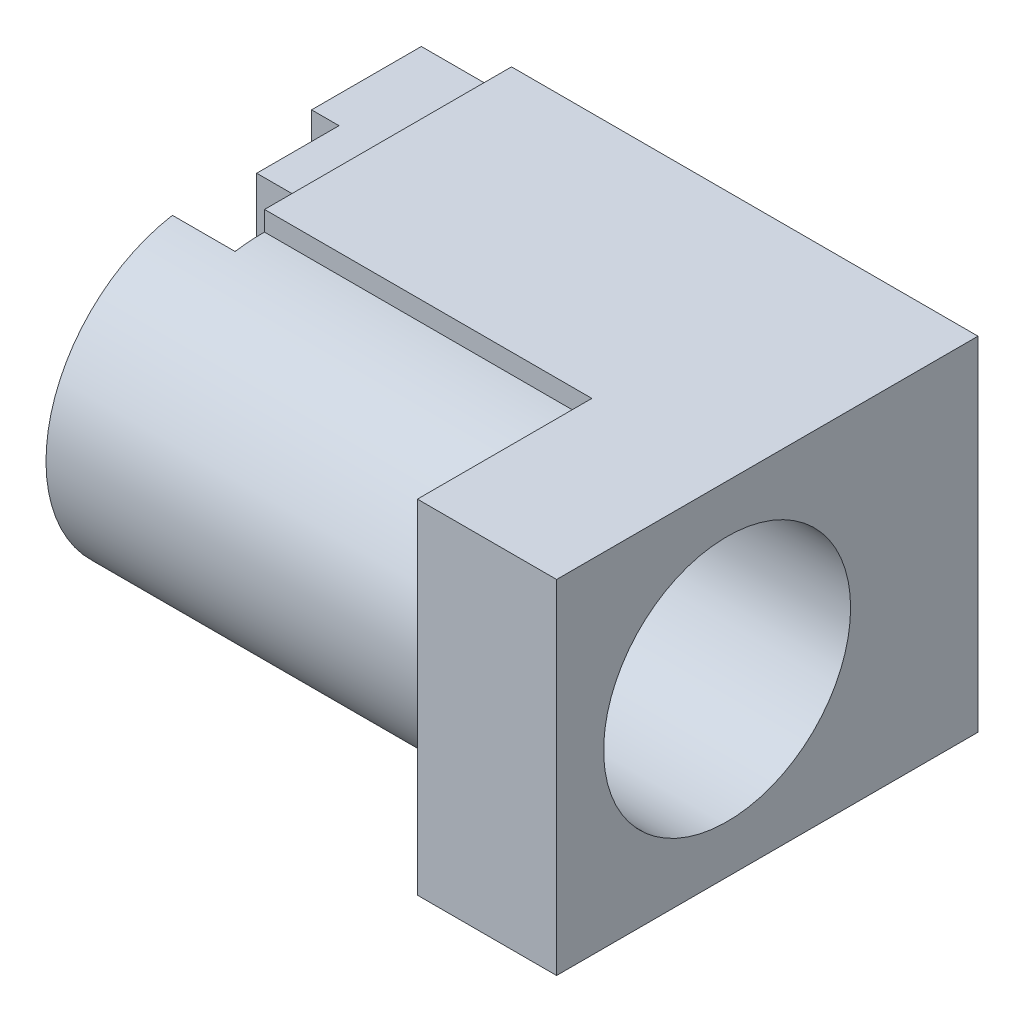
ISO-10303-21;
HEADER;
FILE_DESCRIPTION(('STEP AP214'),'2;1');
FILE_NAME('part.step','',(''),(''),'','','');
FILE_SCHEMA(('AUTOMOTIVE_DESIGN { 1 0 10303 214 1 1 1 1 }'));
ENDSEC;
DATA;
#1=APPLICATION_CONTEXT('core data for automotive mechanical design processes');
#2=APPLICATION_PROTOCOL_DEFINITION('international standard','automotive_design',2000,#1);
#3=PRODUCT_CONTEXT('',#1,'mechanical');
#4=PRODUCT('Part','Part','',(#3));
#5=PRODUCT_RELATED_PRODUCT_CATEGORY('part','',(#4));
#6=PRODUCT_DEFINITION_FORMATION('','',#4);
#7=PRODUCT_DEFINITION_CONTEXT('part definition',#1,'design');
#8=PRODUCT_DEFINITION('design','',#6,#7);
#9=PRODUCT_DEFINITION_SHAPE('','',#8);
#10=(LENGTH_UNIT() NAMED_UNIT(*) SI_UNIT(.MILLI.,.METRE.));
#11=(NAMED_UNIT(*) PLANE_ANGLE_UNIT() SI_UNIT($,.RADIAN.));
#12=(NAMED_UNIT(*) SI_UNIT($,.STERADIAN.) SOLID_ANGLE_UNIT());
#13=UNCERTAINTY_MEASURE_WITH_UNIT(LENGTH_MEASURE(1.E-05),#10,'distance_accuracy_value','');
#14=(GEOMETRIC_REPRESENTATION_CONTEXT(3) GLOBAL_UNCERTAINTY_ASSIGNED_CONTEXT((#13)) GLOBAL_UNIT_ASSIGNED_CONTEXT((#10,
#11,#12)) REPRESENTATION_CONTEXT('',''));
#15=CARTESIAN_POINT('',(0.,0.,0.));
#16=DIRECTION('',(0.,0.,1.));
#17=DIRECTION('',(1.,0.,0.));
#18=AXIS2_PLACEMENT_3D('',#15,#16,#17);
#19=CARTESIAN_POINT('',(-9.95,-3.87370946251781,2.8));
#20=DIRECTION('',(0.,0.,1.));
#21=DIRECTION('',(1.,0.,0.));
#22=AXIS2_PLACEMENT_3D('',#19,#20,#21);
#23=PLANE('',#22);
#24=DIRECTION('',(0.,1.,0.));
#25=VECTOR('',#24,1.);
#26=CARTESIAN_POINT('',(-10.65,-2.63685473125891,2.8));
#27=LINE('',#26,#25);
#28=CARTESIAN_POINT('',(-10.65,-1.4,2.8));
#29=VERTEX_POINT('',#28);
#30=CARTESIAN_POINT('',(-10.65,-3.87370946251781,2.8));
#31=VERTEX_POINT('',#30);
#32=EDGE_CURVE('E200',#29,#31,#27,.F.);
#33=ORIENTED_EDGE('',*,*,#32,.T.);
#34=DIRECTION('',(1.,0.,0.));
#35=VECTOR('',#34,1.);
#36=CARTESIAN_POINT('',(-8.35,-3.87370946251781,2.8));
#37=LINE('',#36,#35);
#38=CARTESIAN_POINT('',(-9.95,-3.87370946251781,2.8));
#39=VERTEX_POINT('',#38);
#40=EDGE_CURVE('E168',#39,#31,#37,.F.);
#41=ORIENTED_EDGE('',*,*,#40,.F.);
#42=DIRECTION('',(0.,1.,0.));
#43=VECTOR('',#42,1.);
#44=CARTESIAN_POINT('',(-9.95,0.139499279654936,2.8));
#45=LINE('',#44,#43);
#46=CARTESIAN_POINT('',(-9.95,-1.4,2.8));
#47=VERTEX_POINT('',#46);
#48=EDGE_CURVE('E178',#39,#47,#45,.T.);
#49=ORIENTED_EDGE('',*,*,#48,.T.);
#50=DIRECTION('',(1.,0.,0.));
#51=VECTOR('',#50,1.);
#52=CARTESIAN_POINT('',(-9.95,-1.4,2.8));
#53=LINE('',#52,#51);
#54=EDGE_CURVE('E276',#29,#47,#53,.T.);
#55=ORIENTED_EDGE('',*,*,#54,.F.);
#56=EDGE_LOOP('',(#33,#41,#49,#55));
#57=FACE_BOUND('',#56,.T.);
#58=ADVANCED_FACE('F16',(#57),#23,.T.);
#59=CARTESIAN_POINT('',(-9.95,-1.4,2.8));
#60=DIRECTION('',(0.,1.,0.));
#61=DIRECTION('',(0.,0.,1.));
#62=AXIS2_PLACEMENT_3D('',#59,#60,#61);
#63=PLANE('',#62);
#64=DIRECTION('',(0.,0.,-1.));
#65=VECTOR('',#64,1.);
#66=CARTESIAN_POINT('',(-10.65,-1.4,1.4));
#67=LINE('',#66,#65);
#68=CARTESIAN_POINT('',(-10.65,-1.4,0.));
#69=VERTEX_POINT('',#68);
#70=EDGE_CURVE('E197',#69,#29,#67,.F.);
#71=ORIENTED_EDGE('',*,*,#70,.T.);
#72=ORIENTED_EDGE('',*,*,#54,.T.);
#73=DIRECTION('',(0.,0.,-1.));
#74=VECTOR('',#73,1.);
#75=CARTESIAN_POINT('',(-9.95,-1.4,4.32299122435101));
#76=LINE('',#75,#74);
#77=CARTESIAN_POINT('',(-9.95,-1.4,0.));
#78=VERTEX_POINT('',#77);
#79=EDGE_CURVE('E284',#47,#78,#76,.T.);
#80=ORIENTED_EDGE('',*,*,#79,.T.);
#81=DIRECTION('',(1.,0.,0.));
#82=VECTOR('',#81,1.);
#83=CARTESIAN_POINT('',(-9.95,-1.4,0.));
#84=LINE('',#83,#82);
#85=EDGE_CURVE('E278',#78,#69,#84,.F.);
#86=ORIENTED_EDGE('',*,*,#85,.T.);
#87=EDGE_LOOP('',(#71,#72,#80,#86));
#88=FACE_BOUND('',#87,.T.);
#89=ADVANCED_FACE('F344',(#88),#63,.T.);
#90=CARTESIAN_POINT('',(-9.95,1.4,2.8));
#91=DIRECTION('',(0.,0.,1.));
#92=DIRECTION('',(1.,0.,0.));
#93=AXIS2_PLACEMENT_3D('',#90,#91,#92);
#94=PLANE('',#93);
#95=DIRECTION('',(0.,1.,0.));
#96=VECTOR('',#95,1.);
#97=CARTESIAN_POINT('',(-10.65,2.5375,2.8));
#98=LINE('',#97,#96);
#99=CARTESIAN_POINT('',(-10.65,3.675,2.8));
#100=VERTEX_POINT('',#99);
#101=CARTESIAN_POINT('',(-10.65,1.4,2.8));
#102=VERTEX_POINT('',#101);
#103=EDGE_CURVE('E336',#100,#102,#98,.F.);
#104=ORIENTED_EDGE('',*,*,#103,.T.);
#105=DIRECTION('',(1.,0.,0.));
#106=VECTOR('',#105,1.);
#107=CARTESIAN_POINT('',(-9.95,1.4,2.8));
#108=LINE('',#107,#106);
#109=CARTESIAN_POINT('',(-9.95,1.4,2.8));
#110=VERTEX_POINT('',#109);
#111=EDGE_CURVE('E272',#110,#102,#108,.F.);
#112=ORIENTED_EDGE('',*,*,#111,.F.);
#113=DIRECTION('',(0.,1.,0.));
#114=VECTOR('',#113,1.);
#115=CARTESIAN_POINT('',(-9.95,0.139499279654936,2.8));
#116=LINE('',#115,#114);
#117=CARTESIAN_POINT('',(-9.95,3.675,2.8));
#118=VERTEX_POINT('',#117);
#119=EDGE_CURVE('E193',#110,#118,#116,.T.);
#120=ORIENTED_EDGE('',*,*,#119,.T.);
#121=DIRECTION('',(1.,0.,0.));
#122=VECTOR('',#121,1.);
#123=CARTESIAN_POINT('',(-9.95,3.675,2.8));
#124=LINE('',#123,#122);
#125=EDGE_CURVE('E274',#118,#100,#124,.F.);
#126=ORIENTED_EDGE('',*,*,#125,.T.);
#127=EDGE_LOOP('',(#104,#112,#120,#126));
#128=FACE_BOUND('',#127,.T.);
#129=ADVANCED_FACE('F583',(#128),#94,.T.);
#130=CARTESIAN_POINT('',(-9.95,1.4,0.));
#131=DIRECTION('',(0.,-1.,0.));
#132=DIRECTION('',(0.,0.,-1.));
#133=AXIS2_PLACEMENT_3D('',#130,#131,#132);
#134=PLANE('',#133);
#135=DIRECTION('',(0.,0.,-1.));
#136=VECTOR('',#135,1.);
#137=CARTESIAN_POINT('',(-10.65,1.4,1.4));
#138=LINE('',#137,#136);
#139=CARTESIAN_POINT('',(-10.65,1.4,0.));
#140=VERTEX_POINT('',#139);
#141=EDGE_CURVE('E333',#102,#140,#138,.T.);
#142=ORIENTED_EDGE('',*,*,#141,.T.);
#143=DIRECTION('',(1.,0.,0.));
#144=VECTOR('',#143,1.);
#145=CARTESIAN_POINT('',(-9.95,1.4,0.));
#146=LINE('',#145,#144);
#147=CARTESIAN_POINT('',(-9.95,1.4,0.));
#148=VERTEX_POINT('',#147);
#149=EDGE_CURVE('E267',#140,#148,#146,.T.);
#150=ORIENTED_EDGE('',*,*,#149,.T.);
#151=DIRECTION('',(0.,0.,-1.));
#152=VECTOR('',#151,1.);
#153=CARTESIAN_POINT('',(-9.95,1.4,4.32299122435101));
#154=LINE('',#153,#152);
#155=EDGE_CURVE('E339',#148,#110,#154,.F.);
#156=ORIENTED_EDGE('',*,*,#155,.T.);
#157=ORIENTED_EDGE('',*,*,#111,.T.);
#158=EDGE_LOOP('',(#142,#150,#156,#157));
#159=FACE_BOUND('',#158,.T.);
#160=ADVANCED_FACE('F576',(#159),#134,.T.);
#161=CARTESIAN_POINT('',(-8.35,3.8200948941093,7.05000000000001));
#162=DIRECTION('',(0.,0.,-1.));
#163=DIRECTION('',(-1.,0.,0.));
#164=AXIS2_PLACEMENT_3D('',#161,#162,#163);
#165=PLANE('',#164);
#166=DIRECTION('',(0.,1.,0.));
#167=VECTOR('',#166,1.);
#168=CARTESIAN_POINT('',(-9.95,0.139499279654936,7.04999999999999));
#169=LINE('',#168,#167);
#170=CARTESIAN_POINT('',(-9.95,2.225,7.04999999999999));
#171=VERTEX_POINT('',#170);
#172=CARTESIAN_POINT('',(-9.95,3.82009489410931,7.05));
#173=VERTEX_POINT('',#172);
#174=EDGE_CURVE('E181',#171,#173,#169,.T.);
#175=ORIENTED_EDGE('',*,*,#174,.T.);
#176=DIRECTION('',(1.,0.,0.));
#177=VECTOR('',#176,1.);
#178=CARTESIAN_POINT('',(-8.35,3.82009489410931,7.05000000000001));
#179=LINE('',#178,#177);
#180=CARTESIAN_POINT('',(-8.35,3.82009489410931,7.05000000000001));
#181=VERTEX_POINT('',#180);
#182=EDGE_CURVE('E153',#181,#173,#179,.F.);
#183=ORIENTED_EDGE('',*,*,#182,.F.);
#184=DIRECTION('',(0.,1.,0.));
#185=VECTOR('',#184,1.);
#186=CARTESIAN_POINT('',(-8.35,0.,7.05000000000001));
#187=LINE('',#186,#185);
#188=CARTESIAN_POINT('',(-8.35,2.22499999999999,7.05));
#189=VERTEX_POINT('',#188);
#190=EDGE_CURVE('E261',#181,#189,#187,.F.);
#191=ORIENTED_EDGE('',*,*,#190,.T.);
#192=DIRECTION('',(1.,0.,0.));
#193=VECTOR('',#192,1.);
#194=CARTESIAN_POINT('',(-8.35,2.22499999999999,7.04999999999999));
#195=LINE('',#194,#193);
#196=EDGE_CURVE('E264',#171,#189,#195,.T.);
#197=ORIENTED_EDGE('',*,*,#196,.F.);
#198=EDGE_LOOP('',(#175,#183,#191,#197));
#199=FACE_BOUND('',#198,.T.);
#200=ADVANCED_FACE('F568',(#199),#165,.T.);
#201=CARTESIAN_POINT('',(-8.35,2.22499999999999,7.04999999999999));
#202=DIRECTION('',(0.,1.,0.));
#203=DIRECTION('',(0.,0.,1.));
#204=AXIS2_PLACEMENT_3D('',#201,#202,#203);
#205=PLANE('',#204);
#206=DIRECTION('',(0.,0.,-1.));
#207=VECTOR('',#206,1.);
#208=CARTESIAN_POINT('',(-9.95,2.22500000000001,4.32299122435101));
#209=LINE('',#208,#207);
#210=CARTESIAN_POINT('',(-9.95,2.22500000000001,4.9));
#211=VERTEX_POINT('',#210);
#212=EDGE_CURVE('E182',#211,#171,#209,.F.);
#213=ORIENTED_EDGE('',*,*,#212,.T.);
#214=ORIENTED_EDGE('',*,*,#196,.T.);
#215=DIRECTION('',(0.,0.,-1.));
#216=VECTOR('',#215,1.);
#217=CARTESIAN_POINT('',(-8.35,2.22499999999999,6.8163070588683));
#218=LINE('',#217,#216);
#219=CARTESIAN_POINT('',(-8.35,2.225,4.89999999999999));
#220=VERTEX_POINT('',#219);
#221=EDGE_CURVE('E257',#189,#220,#218,.T.);
#222=ORIENTED_EDGE('',*,*,#221,.T.);
#223=DIRECTION('',(1.,0.,0.));
#224=VECTOR('',#223,1.);
#225=CARTESIAN_POINT('',(-8.35,2.22500000000001,4.89999999999999));
#226=LINE('',#225,#224);
#227=EDGE_CURVE('E266',#211,#220,#226,.T.);
#228=ORIENTED_EDGE('',*,*,#227,.F.);
#229=EDGE_LOOP('',(#213,#214,#222,#228));
#230=FACE_BOUND('',#229,.T.);
#231=ADVANCED_FACE('F560',(#230),#205,.T.);
#232=CARTESIAN_POINT('',(-8.35,2.22500000000001,4.89999999999999));
#233=DIRECTION('',(0.,0.,1.));
#234=DIRECTION('',(1.,0.,0.));
#235=AXIS2_PLACEMENT_3D('',#232,#233,#234);
#236=PLANE('',#235);
#237=DIRECTION('',(0.,1.,0.));
#238=VECTOR('',#237,1.);
#239=CARTESIAN_POINT('',(-9.95,0.139499279654936,4.90000000000001));
#240=LINE('',#239,#238);
#241=CARTESIAN_POINT('',(-9.95,3.675,4.90000000000001));
#242=VERTEX_POINT('',#241);
#243=EDGE_CURVE('E186',#242,#211,#240,.F.);
#244=ORIENTED_EDGE('',*,*,#243,.T.);
#245=ORIENTED_EDGE('',*,*,#227,.T.);
#246=DIRECTION('',(0.,1.,0.));
#247=VECTOR('',#246,1.);
#248=CARTESIAN_POINT('',(-8.35,0.,4.89999999999999));
#249=LINE('',#248,#247);
#250=CARTESIAN_POINT('',(-8.35,3.675,4.89999999999999));
#251=VERTEX_POINT('',#250);
#252=EDGE_CURVE('E260',#220,#251,#249,.T.);
#253=ORIENTED_EDGE('',*,*,#252,.T.);
#254=DIRECTION('',(1.,0.,0.));
#255=VECTOR('',#254,1.);
#256=CARTESIAN_POINT('',(-8.35,3.675,4.90000000000001));
#257=LINE('',#256,#255);
#258=EDGE_CURVE('E299',#242,#251,#257,.T.);
#259=ORIENTED_EDGE('',*,*,#258,.F.);
#260=EDGE_LOOP('',(#244,#245,#253,#259));
#261=FACE_BOUND('',#260,.T.);
#262=ADVANCED_FACE('F553',(#261),#236,.T.);
#263=CARTESIAN_POINT('',(-8.35,0.,6.4));
#264=DIRECTION('',(1.,0.,0.));
#265=DIRECTION('',(0.,0.,-1.));
#266=AXIS2_PLACEMENT_3D('',#263,#264,#265);
#267=CYLINDRICAL_SURFACE('',#266,3.875);
#268=DIRECTION('',(1.,0.,0.));
#269=VECTOR('',#268,1.);
#270=CARTESIAN_POINT('',(-8.35,-3.87370946251781,6.30000000000001));
#271=LINE('',#270,#269);
#272=CARTESIAN_POINT('',(-8.35,-3.87370946251781,6.3));
#273=VERTEX_POINT('',#272);
#274=CARTESIAN_POINT('',(-9.95,-3.87370946251781,6.30000000000002));
#275=VERTEX_POINT('',#274);
#276=EDGE_CURVE('E160',#273,#275,#271,.F.);
#277=ORIENTED_EDGE('',*,*,#276,.F.);
#278=DIRECTION('',(1.,0.,0.));
#279=VECTOR('',#278,1.);
#280=CARTESIAN_POINT('',(0.,-3.87370946251781,6.3));
#281=LINE('',#280,#279);
#282=CARTESIAN_POINT('',(0.,-3.87370946251781,6.3));
#283=VERTEX_POINT('',#282);
#284=EDGE_CURVE('E201',#283,#273,#281,.F.);
#285=ORIENTED_EDGE('',*,*,#284,.F.);
#286=CARTESIAN_POINT('',(0.,0.,6.4));
#287=DIRECTION('',(1.,0.,0.));
#288=DIRECTION('',(0.,0.,-1.));
#289=AXIS2_PLACEMENT_3D('',#286,#287,#288);
#290=CIRCLE('',#289,3.875);
#291=CARTESIAN_POINT('',(0.,3.87370946251781,6.3));
#292=VERTEX_POINT('',#291);
#293=EDGE_CURVE('E204',#283,#292,#290,.F.);
#294=ORIENTED_EDGE('',*,*,#293,.T.);
#295=DIRECTION('',(1.,0.,0.));
#296=VECTOR('',#295,1.);
#297=CARTESIAN_POINT('',(0.,3.87370946251781,6.3));
#298=LINE('',#297,#296);
#299=CARTESIAN_POINT('',(-8.35,3.87370946251781,6.3));
#300=VERTEX_POINT('',#299);
#301=EDGE_CURVE('E232',#300,#292,#298,.T.);
#302=ORIENTED_EDGE('',*,*,#301,.F.);
#303=CARTESIAN_POINT('',(-8.35,0.,6.4));
#304=DIRECTION('',(1.,0.,0.));
#305=DIRECTION('',(0.,0.,-1.));
#306=AXIS2_PLACEMENT_3D('',#303,#304,#305);
#307=CIRCLE('',#306,3.875);
#308=EDGE_CURVE('E304',#300,#181,#307,.T.);
#309=ORIENTED_EDGE('',*,*,#308,.T.);
#310=ORIENTED_EDGE('',*,*,#182,.T.);
#311=CARTESIAN_POINT('',(-9.95,0.,6.4));
#312=DIRECTION('',(1.,0.,0.));
#313=DIRECTION('',(0.,0.,-1.));
#314=AXIS2_PLACEMENT_3D('',#311,#312,#313);
#315=CIRCLE('',#314,3.875);
#316=EDGE_CURVE('E19',#173,#275,#315,.T.);
#317=ORIENTED_EDGE('',*,*,#316,.T.);
#318=EDGE_LOOP('',(#277,#285,#294,#302,#309,#310,#317));
#319=FACE_BOUND('',#318,.T.);
#320=ADVANCED_FACE('F180',(#319),#267,.T.);
#321=CARTESIAN_POINT('',(-8.35,-3.87370946251781,0.));
#322=DIRECTION('',(0.,-1.,0.));
#323=DIRECTION('',(0.,0.,-1.));
#324=AXIS2_PLACEMENT_3D('',#321,#322,#323);
#325=PLANE('',#324);
#326=DIRECTION('',(0.,0.,-1.));
#327=VECTOR('',#326,1.);
#328=CARTESIAN_POINT('',(-10.65,-3.87370946251781,1.4));
#329=LINE('',#328,#327);
#330=CARTESIAN_POINT('',(-10.65,-3.87370946251781,0.));
#331=VERTEX_POINT('',#330);
#332=EDGE_CURVE('E196',#31,#331,#329,.T.);
#333=ORIENTED_EDGE('',*,*,#332,.T.);
#334=DIRECTION('',(-1.,0.,0.));
#335=VECTOR('',#334,1.);
#336=CARTESIAN_POINT('',(0.,-3.87370946251781,0.));
#337=LINE('',#336,#335);
#338=CARTESIAN_POINT('',(-8.35,-3.87370946251781,0.));
#339=VERTEX_POINT('',#338);
#340=EDGE_CURVE('E356',#339,#331,#337,.T.);
#341=ORIENTED_EDGE('',*,*,#340,.F.);
#342=DIRECTION('',(0.,0.,-1.));
#343=VECTOR('',#342,1.);
#344=CARTESIAN_POINT('',(-8.35,-3.87370946251781,6.8163070588683));
#345=LINE('',#344,#343);
#346=EDGE_CURVE('E166',#339,#273,#345,.F.);
#347=ORIENTED_EDGE('',*,*,#346,.T.);
#348=ORIENTED_EDGE('',*,*,#276,.T.);
#349=DIRECTION('',(0.,0.,-1.));
#350=VECTOR('',#349,1.);
#351=CARTESIAN_POINT('',(-9.95,-3.87370946251781,4.32299122435101));
#352=LINE('',#351,#350);
#353=EDGE_CURVE('E164',#275,#39,#352,.T.);
#354=ORIENTED_EDGE('',*,*,#353,.T.);
#355=ORIENTED_EDGE('',*,*,#40,.T.);
#356=EDGE_LOOP('',(#333,#341,#347,#348,#354,#355));
#357=FACE_BOUND('',#356,.T.);
#358=ADVANCED_FACE('F163',(#357),#325,.T.);
#359=CARTESIAN_POINT('',(-10.65,-2.63685473125891,1.4));
#360=DIRECTION('',(1.,0.,0.));
#361=DIRECTION('',(0.,0.,-1.));
#362=AXIS2_PLACEMENT_3D('',#359,#360,#361);
#363=PLANE('',#362);
#364=ORIENTED_EDGE('',*,*,#32,.F.);
#365=ORIENTED_EDGE('',*,*,#70,.F.);
#366=DIRECTION('',(0.,1.,0.));
#367=VECTOR('',#366,1.);
#368=CARTESIAN_POINT('',(-10.65,-4.375,0.));
#369=LINE('',#368,#367);
#370=EDGE_CURVE('E351',#331,#69,#369,.T.);
#371=ORIENTED_EDGE('',*,*,#370,.F.);
#372=ORIENTED_EDGE('',*,*,#332,.F.);
#373=EDGE_LOOP('',(#364,#365,#371,#372));
#374=FACE_BOUND('',#373,.T.);
#375=ADVANCED_FACE('F533',(#374),#363,.F.);
#376=CARTESIAN_POINT('',(-9.95,0.139499279654936,4.32299122435101));
#377=DIRECTION('',(1.,0.,0.));
#378=DIRECTION('',(0.,0.,-1.));
#379=AXIS2_PLACEMENT_3D('',#376,#377,#378);
#380=PLANE('',#379);
#381=DIRECTION('',(0.,1.,0.));
#382=VECTOR('',#381,1.);
#383=CARTESIAN_POINT('',(-9.95,-4.375,0.));
#384=LINE('',#383,#382);
#385=EDGE_CURVE('E348',#78,#148,#384,.T.);
#386=ORIENTED_EDGE('',*,*,#385,.F.);
#387=ORIENTED_EDGE('',*,*,#79,.F.);
#388=ORIENTED_EDGE('',*,*,#48,.F.);
#389=ORIENTED_EDGE('',*,*,#353,.F.);
#390=ORIENTED_EDGE('',*,*,#316,.F.);
#391=ORIENTED_EDGE('',*,*,#174,.F.);
#392=ORIENTED_EDGE('',*,*,#212,.F.);
#393=ORIENTED_EDGE('',*,*,#243,.F.);
#394=DIRECTION('',(0.,0.,1.));
#395=VECTOR('',#394,1.);
#396=CARTESIAN_POINT('',(-9.95,3.675,4.90000000000001));
#397=LINE('',#396,#395);
#398=EDGE_CURVE('E296',#118,#242,#397,.T.);
#399=ORIENTED_EDGE('',*,*,#398,.F.);
#400=ORIENTED_EDGE('',*,*,#119,.F.);
#401=ORIENTED_EDGE('',*,*,#155,.F.);
#402=EDGE_LOOP('',(#386,#387,#388,#389,#390,#391,#392,#393,#399,#400,#401));
#403=FACE_BOUND('',#402,.T.);
#404=ADVANCED_FACE('F173',(#403),#380,.F.);
#405=CARTESIAN_POINT('',(-10.65,2.5375,1.4));
#406=DIRECTION('',(1.,0.,0.));
#407=DIRECTION('',(0.,0.,-1.));
#408=AXIS2_PLACEMENT_3D('',#405,#406,#407);
#409=PLANE('',#408);
#410=ORIENTED_EDGE('',*,*,#141,.F.);
#411=ORIENTED_EDGE('',*,*,#103,.F.);
#412=DIRECTION('',(0.,0.,1.));
#413=VECTOR('',#412,1.);
#414=CARTESIAN_POINT('',(-10.65,3.675,4.90000000000001));
#415=LINE('',#414,#413);
#416=CARTESIAN_POINT('',(-10.65,3.675,0.));
#417=VERTEX_POINT('',#416);
#418=EDGE_CURVE('E300',#417,#100,#415,.T.);
#419=ORIENTED_EDGE('',*,*,#418,.F.);
#420=DIRECTION('',(0.,1.,0.));
#421=VECTOR('',#420,1.);
#422=CARTESIAN_POINT('',(-10.65,-4.375,0.));
#423=LINE('',#422,#421);
#424=EDGE_CURVE('E350',#140,#417,#423,.T.);
#425=ORIENTED_EDGE('',*,*,#424,.F.);
#426=EDGE_LOOP('',(#410,#411,#419,#425));
#427=FACE_BOUND('',#426,.T.);
#428=ADVANCED_FACE('F519',(#427),#409,.F.);
#429=CARTESIAN_POINT('',(-8.35,3.675,4.90000000000001));
#430=DIRECTION('',(0.,1.,0.));
#431=DIRECTION('',(0.,0.,1.));
#432=AXIS2_PLACEMENT_3D('',#429,#430,#431);
#433=PLANE('',#432);
#434=ORIENTED_EDGE('',*,*,#398,.T.);
#435=ORIENTED_EDGE('',*,*,#258,.T.);
#436=DIRECTION('',(0.,0.,-1.));
#437=VECTOR('',#436,1.);
#438=CARTESIAN_POINT('',(-8.35,3.675,6.8163070588683));
#439=LINE('',#438,#437);
#440=CARTESIAN_POINT('',(-8.35,3.675,0.));
#441=VERTEX_POINT('',#440);
#442=EDGE_CURVE('E235',#251,#441,#439,.T.);
#443=ORIENTED_EDGE('',*,*,#442,.T.);
#444=DIRECTION('',(-1.,0.,0.));
#445=VECTOR('',#444,1.);
#446=CARTESIAN_POINT('',(0.,3.675,0.));
#447=LINE('',#446,#445);
#448=EDGE_CURVE('E353',#417,#441,#447,.F.);
#449=ORIENTED_EDGE('',*,*,#448,.F.);
#450=ORIENTED_EDGE('',*,*,#418,.T.);
#451=ORIENTED_EDGE('',*,*,#125,.F.);
#452=EDGE_LOOP('',(#434,#435,#443,#449,#450,#451));
#453=FACE_BOUND('',#452,.T.);
#454=ADVANCED_FACE('F397',(#453),#433,.T.);
#455=CARTESIAN_POINT('',(-8.35,0.,6.8163070588683));
#456=DIRECTION('',(1.,0.,0.));
#457=DIRECTION('',(0.,0.,-1.));
#458=AXIS2_PLACEMENT_3D('',#455,#456,#457);
#459=PLANE('',#458);
#460=ORIENTED_EDGE('',*,*,#252,.F.);
#461=ORIENTED_EDGE('',*,*,#221,.F.);
#462=ORIENTED_EDGE('',*,*,#190,.F.);
#463=ORIENTED_EDGE('',*,*,#308,.F.);
#464=DIRECTION('',(0.,1.,0.));
#465=VECTOR('',#464,1.);
#466=CARTESIAN_POINT('',(-8.35,3.14841229828623,6.3));
#467=LINE('',#466,#465);
#468=CARTESIAN_POINT('',(-8.35,4.375,6.3));
#469=VERTEX_POINT('',#468);
#470=EDGE_CURVE('E234',#469,#300,#467,.F.);
#471=ORIENTED_EDGE('',*,*,#470,.F.);
#472=DIRECTION('',(0.,0.,1.));
#473=VECTOR('',#472,1.);
#474=CARTESIAN_POINT('',(-8.35,4.375,0.));
#475=LINE('',#474,#473);
#476=CARTESIAN_POINT('',(-8.35,4.375,0.));
#477=VERTEX_POINT('',#476);
#478=EDGE_CURVE('E240',#477,#469,#475,.T.);
#479=ORIENTED_EDGE('',*,*,#478,.F.);
#480=DIRECTION('',(0.,1.,0.));
#481=VECTOR('',#480,1.);
#482=CARTESIAN_POINT('',(-8.35,-4.375,0.));
#483=LINE('',#482,#481);
#484=EDGE_CURVE('E246',#441,#477,#483,.T.);
#485=ORIENTED_EDGE('',*,*,#484,.F.);
#486=ORIENTED_EDGE('',*,*,#442,.F.);
#487=EDGE_LOOP('',(#460,#461,#462,#463,#471,#479,#485,#486));
#488=FACE_BOUND('',#487,.T.);
#489=ADVANCED_FACE('F401',(#488),#459,.F.);
#490=CARTESIAN_POINT('',(0.,3.14841229828623,6.3));
#491=DIRECTION('',(0.,0.,1.));
#492=DIRECTION('',(1.,0.,0.));
#493=AXIS2_PLACEMENT_3D('',#490,#491,#492);
#494=PLANE('',#493);
#495=DIRECTION('',(1.,0.,0.));
#496=VECTOR('',#495,1.);
#497=CARTESIAN_POINT('',(0.,4.375,6.3));
#498=LINE('',#497,#496);
#499=CARTESIAN_POINT('',(0.,4.375,6.3));
#500=VERTEX_POINT('',#499);
#501=EDGE_CURVE('E236',#469,#500,#498,.T.);
#502=ORIENTED_EDGE('',*,*,#501,.F.);
#503=ORIENTED_EDGE('',*,*,#470,.T.);
#504=ORIENTED_EDGE('',*,*,#301,.T.);
#505=DIRECTION('',(0.,1.,0.));
#506=VECTOR('',#505,1.);
#507=CARTESIAN_POINT('',(0.,0.,6.3));
#508=LINE('',#507,#506);
#509=EDGE_CURVE('E251',#292,#500,#508,.T.);
#510=ORIENTED_EDGE('',*,*,#509,.T.);
#511=EDGE_LOOP('',(#502,#503,#504,#510));
#512=FACE_BOUND('',#511,.T.);
#513=ADVANCED_FACE('F367',(#512),#494,.T.);
#514=CARTESIAN_POINT('',(0.,0.,5.375));
#515=DIRECTION('',(1.,0.,0.));
#516=DIRECTION('',(0.,0.,-1.));
#517=AXIS2_PLACEMENT_3D('',#514,#515,#516);
#518=PLANE('',#517);
#519=DIRECTION('',(0.,1.,0.));
#520=VECTOR('',#519,1.);
#521=CARTESIAN_POINT('',(0.,-4.375,6.3));
#522=LINE('',#521,#520);
#523=CARTESIAN_POINT('',(0.,-4.375,6.3));
#524=VERTEX_POINT('',#523);
#525=EDGE_CURVE('E203',#524,#283,#522,.T.);
#526=ORIENTED_EDGE('',*,*,#525,.F.);
#527=DIRECTION('',(0.,0.,-1.));
#528=VECTOR('',#527,1.);
#529=CARTESIAN_POINT('',(0.,-4.375,10.75));
#530=LINE('',#529,#528);
#531=CARTESIAN_POINT('',(0.,-4.375,10.75));
#532=VERTEX_POINT('',#531);
#533=EDGE_CURVE('E212',#532,#524,#530,.T.);
#534=ORIENTED_EDGE('',*,*,#533,.F.);
#535=DIRECTION('',(0.,1.,0.));
#536=VECTOR('',#535,1.);
#537=CARTESIAN_POINT('',(0.,4.375,10.75));
#538=LINE('',#537,#536);
#539=CARTESIAN_POINT('',(0.,4.375,10.75));
#540=VERTEX_POINT('',#539);
#541=EDGE_CURVE('E239',#540,#532,#538,.F.);
#542=ORIENTED_EDGE('',*,*,#541,.F.);
#543=DIRECTION('',(0.,0.,1.));
#544=VECTOR('',#543,1.);
#545=CARTESIAN_POINT('',(0.,4.375,0.));
#546=LINE('',#545,#544);
#547=EDGE_CURVE('E243',#500,#540,#546,.T.);
#548=ORIENTED_EDGE('',*,*,#547,.F.);
#549=ORIENTED_EDGE('',*,*,#509,.F.);
#550=ORIENTED_EDGE('',*,*,#293,.F.);
#551=EDGE_LOOP('',(#526,#534,#542,#548,#549,#550));
#552=FACE_BOUND('',#551,.T.);
#553=ADVANCED_FACE('F379',(#552),#518,.F.);
#554=CARTESIAN_POINT('',(0.,-4.375,6.3));
#555=DIRECTION('',(0.,0.,1.));
#556=DIRECTION('',(1.,0.,0.));
#557=AXIS2_PLACEMENT_3D('',#554,#555,#556);
#558=PLANE('',#557);
#559=DIRECTION('',(1.,0.,0.));
#560=VECTOR('',#559,1.);
#561=CARTESIAN_POINT('',(0.,-4.375,6.3));
#562=LINE('',#561,#560);
#563=CARTESIAN_POINT('',(-8.35,-4.375,6.3));
#564=VERTEX_POINT('',#563);
#565=EDGE_CURVE('E214',#524,#564,#562,.F.);
#566=ORIENTED_EDGE('',*,*,#565,.F.);
#567=ORIENTED_EDGE('',*,*,#525,.T.);
#568=ORIENTED_EDGE('',*,*,#284,.T.);
#569=DIRECTION('',(0.,1.,0.));
#570=VECTOR('',#569,1.);
#571=CARTESIAN_POINT('',(-8.35,0.,6.30000000000001));
#572=LINE('',#571,#570);
#573=EDGE_CURVE('E209',#273,#564,#572,.F.);
#574=ORIENTED_EDGE('',*,*,#573,.T.);
#575=EDGE_LOOP('',(#566,#567,#568,#574));
#576=FACE_BOUND('',#575,.T.);
#577=ADVANCED_FACE('F404',(#576),#558,.T.);
#578=CARTESIAN_POINT('',(-8.35,0.,6.8163070588683));
#579=DIRECTION('',(1.,0.,0.));
#580=DIRECTION('',(0.,0.,-1.));
#581=AXIS2_PLACEMENT_3D('',#578,#579,#580);
#582=PLANE('',#581);
#583=DIRECTION('',(0.,1.,0.));
#584=VECTOR('',#583,1.);
#585=CARTESIAN_POINT('',(-8.35,-4.375,0.));
#586=LINE('',#585,#584);
#587=CARTESIAN_POINT('',(-8.35,-4.375,0.));
#588=VERTEX_POINT('',#587);
#589=EDGE_CURVE('E229',#588,#339,#586,.T.);
#590=ORIENTED_EDGE('',*,*,#589,.F.);
#591=DIRECTION('',(0.,0.,-1.));
#592=VECTOR('',#591,1.);
#593=CARTESIAN_POINT('',(-8.35,-4.375,10.75));
#594=LINE('',#593,#592);
#595=EDGE_CURVE('E219',#564,#588,#594,.T.);
#596=ORIENTED_EDGE('',*,*,#595,.F.);
#597=ORIENTED_EDGE('',*,*,#573,.F.);
#598=ORIENTED_EDGE('',*,*,#346,.F.);
#599=EDGE_LOOP('',(#590,#596,#597,#598));
#600=FACE_BOUND('',#599,.T.);
#601=ADVANCED_FACE('F481',(#600),#582,.F.);
#602=CARTESIAN_POINT('',(0.,-4.375,0.));
#603=DIRECTION('',(0.,0.,-1.));
#604=DIRECTION('',(-1.,0.,0.));
#605=AXIS2_PLACEMENT_3D('',#602,#603,#604);
#606=PLANE('',#605);
#607=ORIENTED_EDGE('',*,*,#448,.T.);
#608=ORIENTED_EDGE('',*,*,#484,.T.);
#609=DIRECTION('',(1.,0.,0.));
#610=VECTOR('',#609,1.);
#611=CARTESIAN_POINT('',(0.,4.375,0.));
#612=LINE('',#611,#610);
#613=CARTESIAN_POINT('',(3.55,4.375,0.));
#614=VERTEX_POINT('',#613);
#615=EDGE_CURVE('E245',#614,#477,#612,.F.);
#616=ORIENTED_EDGE('',*,*,#615,.F.);
#617=DIRECTION('',(0.,1.,0.));
#618=VECTOR('',#617,1.);
#619=CARTESIAN_POINT('',(3.55,0.,0.));
#620=LINE('',#619,#618);
#621=CARTESIAN_POINT('',(3.55,-4.375,0.));
#622=VERTEX_POINT('',#621);
#623=EDGE_CURVE('E412',#622,#614,#620,.T.);
#624=ORIENTED_EDGE('',*,*,#623,.F.);
#625=DIRECTION('',(1.,0.,0.));
#626=VECTOR('',#625,1.);
#627=CARTESIAN_POINT('',(0.,-4.375,0.));
#628=LINE('',#627,#626);
#629=EDGE_CURVE('E413',#588,#622,#628,.T.);
#630=ORIENTED_EDGE('',*,*,#629,.F.);
#631=ORIENTED_EDGE('',*,*,#589,.T.);
#632=ORIENTED_EDGE('',*,*,#340,.T.);
#633=ORIENTED_EDGE('',*,*,#370,.T.);
#634=ORIENTED_EDGE('',*,*,#85,.F.);
#635=ORIENTED_EDGE('',*,*,#385,.T.);
#636=ORIENTED_EDGE('',*,*,#149,.F.);
#637=ORIENTED_EDGE('',*,*,#424,.T.);
#638=EDGE_LOOP('',(#607,#608,#616,#624,#630,#631,#632,#633,#634,#635,#636,#637));
#639=FACE_BOUND('',#638,.T.);
#640=ADVANCED_FACE('F390',(#639),#606,.T.);
#641=CARTESIAN_POINT('',(0.,4.375,0.));
#642=DIRECTION('',(0.,1.,0.));
#643=DIRECTION('',(0.,0.,1.));
#644=AXIS2_PLACEMENT_3D('',#641,#642,#643);
#645=PLANE('',#644);
#646=ORIENTED_EDGE('',*,*,#478,.T.);
#647=ORIENTED_EDGE('',*,*,#501,.T.);
#648=ORIENTED_EDGE('',*,*,#547,.T.);
#649=DIRECTION('',(1.,0.,0.));
#650=VECTOR('',#649,1.);
#651=CARTESIAN_POINT('',(0.,4.375,10.75));
#652=LINE('',#651,#650);
#653=CARTESIAN_POINT('',(3.55,4.375,10.75));
#654=VERTEX_POINT('',#653);
#655=EDGE_CURVE('E215',#654,#540,#652,.F.);
#656=ORIENTED_EDGE('',*,*,#655,.F.);
#657=DIRECTION('',(0.,0.,-1.));
#658=VECTOR('',#657,1.);
#659=CARTESIAN_POINT('',(3.55,4.375,5.375));
#660=LINE('',#659,#658);
#661=EDGE_CURVE('E415',#614,#654,#660,.F.);
#662=ORIENTED_EDGE('',*,*,#661,.F.);
#663=ORIENTED_EDGE('',*,*,#615,.T.);
#664=EDGE_LOOP('',(#646,#647,#648,#656,#662,#663));
#665=FACE_BOUND('',#664,.T.);
#666=ADVANCED_FACE('F371',(#665),#645,.T.);
#667=CARTESIAN_POINT('',(0.,4.375,10.75));
#668=DIRECTION('',(0.,0.,1.));
#669=DIRECTION('',(1.,0.,0.));
#670=AXIS2_PLACEMENT_3D('',#667,#668,#669);
#671=PLANE('',#670);
#672=DIRECTION('',(0.,1.,0.));
#673=VECTOR('',#672,1.);
#674=CARTESIAN_POINT('',(3.55,0.,10.75));
#675=LINE('',#674,#673);
#676=CARTESIAN_POINT('',(3.55,-4.375,10.75));
#677=VERTEX_POINT('',#676);
#678=EDGE_CURVE('E34',#654,#677,#675,.F.);
#679=ORIENTED_EDGE('',*,*,#678,.F.);
#680=ORIENTED_EDGE('',*,*,#655,.T.);
#681=ORIENTED_EDGE('',*,*,#541,.T.);
#682=DIRECTION('',(1.,0.,0.));
#683=VECTOR('',#682,1.);
#684=CARTESIAN_POINT('',(0.,-4.375,10.75));
#685=LINE('',#684,#683);
#686=EDGE_CURVE('E411',#677,#532,#685,.F.);
#687=ORIENTED_EDGE('',*,*,#686,.F.);
#688=EDGE_LOOP('',(#679,#680,#681,#687));
#689=FACE_BOUND('',#688,.T.);
#690=ADVANCED_FACE('F425',(#689),#671,.T.);
#691=CARTESIAN_POINT('',(0.,-4.375,10.75));
#692=DIRECTION('',(0.,-1.,0.));
#693=DIRECTION('',(0.,0.,-1.));
#694=AXIS2_PLACEMENT_3D('',#691,#692,#693);
#695=PLANE('',#694);
#696=DIRECTION('',(0.,0.,-1.));
#697=VECTOR('',#696,1.);
#698=CARTESIAN_POINT('',(3.55,-4.375,5.375));
#699=LINE('',#698,#697);
#700=EDGE_CURVE('E320',#677,#622,#699,.T.);
#701=ORIENTED_EDGE('',*,*,#700,.F.);
#702=ORIENTED_EDGE('',*,*,#686,.T.);
#703=ORIENTED_EDGE('',*,*,#533,.T.);
#704=ORIENTED_EDGE('',*,*,#565,.T.);
#705=ORIENTED_EDGE('',*,*,#595,.T.);
#706=ORIENTED_EDGE('',*,*,#629,.T.);
#707=EDGE_LOOP('',(#701,#702,#703,#704,#705,#706));
#708=FACE_BOUND('',#707,.T.);
#709=ADVANCED_FACE('F409',(#708),#695,.T.);
#710=CARTESIAN_POINT('',(-5.8,0.,6.4));
#711=DIRECTION('',(1.,0.,0.));
#712=DIRECTION('',(0.,0.,-1.));
#713=AXIS2_PLACEMENT_3D('',#710,#711,#712);
#714=PLANE('',#713);
#715=CARTESIAN_POINT('',(-5.8,0.,6.4));
#716=DIRECTION('',(1.,0.,0.));
#717=DIRECTION('',(0.,0.,-1.));
#718=AXIS2_PLACEMENT_3D('',#715,#716,#717);
#719=CIRCLE('',#718,3.15);
#720=CARTESIAN_POINT('',(-5.8,0.,3.25));
#721=VERTEX_POINT('',#720);
#722=EDGE_CURVE('E25',#721,#721,#719,.T.);
#723=ORIENTED_EDGE('',*,*,#722,.T.);
#724=EDGE_LOOP('',(#723));
#725=FACE_BOUND('',#724,.T.);
#726=ADVANCED_FACE('F433',(#725),#714,.T.);
#727=CARTESIAN_POINT('',(3.55,0.,5.375));
#728=DIRECTION('',(1.,0.,0.));
#729=DIRECTION('',(0.,0.,-1.));
#730=AXIS2_PLACEMENT_3D('',#727,#728,#729);
#731=PLANE('',#730);
#732=CARTESIAN_POINT('',(3.55,0.,6.4));
#733=DIRECTION('',(1.,0.,0.));
#734=DIRECTION('',(0.,0.,-1.));
#735=AXIS2_PLACEMENT_3D('',#732,#733,#734);
#736=CIRCLE('',#735,3.15);
#737=CARTESIAN_POINT('',(3.55,0.,3.25));
#738=VERTEX_POINT('',#737);
#739=EDGE_CURVE('E11',#738,#738,#736,.F.);
#740=ORIENTED_EDGE('',*,*,#739,.T.);
#741=EDGE_LOOP('',(#740));
#742=FACE_BOUND('',#741,.T.);
#743=ORIENTED_EDGE('',*,*,#678,.T.);
#744=ORIENTED_EDGE('',*,*,#700,.T.);
#745=ORIENTED_EDGE('',*,*,#623,.T.);
#746=ORIENTED_EDGE('',*,*,#661,.T.);
#747=EDGE_LOOP('',(#743,#744,#745,#746));
#748=FACE_BOUND('',#747,.T.);
#749=ADVANCED_FACE('F422',(#742,#748),#731,.T.);
#750=CARTESIAN_POINT('',(0.,0.,6.4));
#751=DIRECTION('',(1.,0.,0.));
#752=DIRECTION('',(0.,0.,-1.));
#753=AXIS2_PLACEMENT_3D('',#750,#751,#752);
#754=CYLINDRICAL_SURFACE('',#753,3.15);
#755=ORIENTED_EDGE('',*,*,#739,.F.);
#756=EDGE_LOOP('',(#755));
#757=FACE_BOUND('',#756,.T.);
#758=ORIENTED_EDGE('',*,*,#722,.F.);
#759=EDGE_LOOP('',(#758));
#760=FACE_BOUND('',#759,.T.);
#761=ADVANCED_FACE('F436',(#757,#760),#754,.F.);
#762=CLOSED_SHELL('',(#58,#89,#129,#160,#200,#231,#262,#320,#358,#375,#404,#428,#454,#489,#513,
#553,#577,#601,#640,#666,#690,#709,#726,#749,#761));
#763=MANIFOLD_SOLID_BREP('B1',#762);
#764=ADVANCED_BREP_SHAPE_REPRESENTATION('',(#18,#763),#14);
#765=SHAPE_DEFINITION_REPRESENTATION(#9,#764);
ENDSEC;
END-ISO-10303-21;
